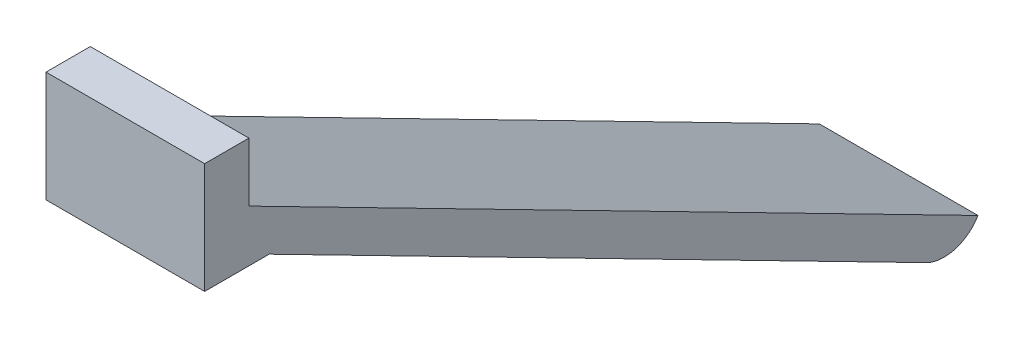
ISO-10303-21;
HEADER;
FILE_DESCRIPTION(('STEP AP214'),'2;1');
FILE_NAME('part.step','',(''),(''),'','','');
FILE_SCHEMA(('AUTOMOTIVE_DESIGN { 1 0 10303 214 1 1 1 1 }'));
ENDSEC;
DATA;
#1=APPLICATION_CONTEXT('core data for automotive mechanical design processes');
#2=APPLICATION_PROTOCOL_DEFINITION('international standard','automotive_design',2000,#1);
#3=PRODUCT_CONTEXT('',#1,'mechanical');
#4=PRODUCT('Part','Part','',(#3));
#5=PRODUCT_RELATED_PRODUCT_CATEGORY('part','',(#4));
#6=PRODUCT_DEFINITION_FORMATION('','',#4);
#7=PRODUCT_DEFINITION_CONTEXT('part definition',#1,'design');
#8=PRODUCT_DEFINITION('design','',#6,#7);
#9=PRODUCT_DEFINITION_SHAPE('','',#8);
#10=(LENGTH_UNIT() NAMED_UNIT(*) SI_UNIT(.MILLI.,.METRE.));
#11=(NAMED_UNIT(*) PLANE_ANGLE_UNIT() SI_UNIT($,.RADIAN.));
#12=(NAMED_UNIT(*) SI_UNIT($,.STERADIAN.) SOLID_ANGLE_UNIT());
#13=UNCERTAINTY_MEASURE_WITH_UNIT(LENGTH_MEASURE(1.E-05),#10,'distance_accuracy_value','');
#14=(GEOMETRIC_REPRESENTATION_CONTEXT(3) GLOBAL_UNCERTAINTY_ASSIGNED_CONTEXT((#13)) GLOBAL_UNIT_ASSIGNED_CONTEXT((#10,
#11,#12)) REPRESENTATION_CONTEXT('',''));
#15=CARTESIAN_POINT('',(0.,0.,0.));
#16=DIRECTION('',(0.,0.,1.));
#17=DIRECTION('',(1.,0.,0.));
#18=AXIS2_PLACEMENT_3D('',#15,#16,#17);
#19=CARTESIAN_POINT('',(4.3,-15.6626151043732,10.5969616533279));
#20=DIRECTION('',(-1.,0.,0.));
#21=DIRECTION('',(0.,0.,1.));
#22=AXIS2_PLACEMENT_3D('',#19,#20,#21);
#23=CYLINDRICAL_SURFACE('',#22,1.06981814994034);
#24=CARTESIAN_POINT('',(0.,-15.6626151043732,10.5969616533279));
#25=DIRECTION('',(1.,0.,0.));
#26=DIRECTION('',(0.,0.,-1.));
#27=AXIS2_PLACEMENT_3D('',#24,#25,#26);
#28=CIRCLE('',#27,1.06981814994034);
#29=CARTESIAN_POINT('',(0.,-16.2106458638047,9.67817268916985));
#30=VERTEX_POINT('',#29);
#31=CARTESIAN_POINT('',(0.,-16.6152107969963,11.0838623827767));
#32=VERTEX_POINT('',#31);
#33=EDGE_CURVE('E123',#30,#32,#28,.F.);
#34=ORIENTED_EDGE('',*,*,#33,.F.);
#35=DIRECTION('',(-1.,0.,0.));
#36=VECTOR('',#35,1.);
#37=CARTESIAN_POINT('',(4.3,-16.2106458638047,9.67817268916985));
#38=LINE('',#37,#36);
#39=CARTESIAN_POINT('',(4.3,-16.2106458638047,9.67817268916985));
#40=VERTEX_POINT('',#39);
#41=EDGE_CURVE('E11',#40,#30,#38,.T.);
#42=ORIENTED_EDGE('',*,*,#41,.F.);
#43=CARTESIAN_POINT('',(4.3,-15.6626151043732,10.5969616533279));
#44=DIRECTION('',(1.,0.,0.));
#45=DIRECTION('',(0.,0.,-1.));
#46=AXIS2_PLACEMENT_3D('',#43,#44,#45);
#47=CIRCLE('',#46,1.06981814994034);
#48=CARTESIAN_POINT('',(4.3,-16.6152107969963,11.0838623827767));
#49=VERTEX_POINT('',#48);
#50=EDGE_CURVE('E138',#40,#49,#47,.F.);
#51=ORIENTED_EDGE('',*,*,#50,.T.);
#52=DIRECTION('',(-1.,0.,0.));
#53=VECTOR('',#52,1.);
#54=CARTESIAN_POINT('',(4.3,-16.6152107969963,11.0838623827767));
#55=LINE('',#54,#53);
#56=EDGE_CURVE('E52',#49,#32,#55,.T.);
#57=ORIENTED_EDGE('',*,*,#56,.T.);
#58=EDGE_LOOP('',(#34,#42,#51,#57));
#59=FACE_BOUND('',#58,.T.);
#60=ADVANCED_FACE('F36',(#59),#23,.T.);
#61=CARTESIAN_POINT('',(4.3,-16.7749307187408,8.57417902123448));
#62=DIRECTION('',(0.,-0.890427679392244,0.455124760666944));
#63=DIRECTION('',(0.,-0.455124760666944,-0.890427679392244));
#64=AXIS2_PLACEMENT_3D('',#61,#62,#63);
#65=PLANE('',#64);
#66=DIRECTION('',(0.,0.455124760666944,0.890427679392244));
#67=VECTOR('',#66,1.);
#68=CARTESIAN_POINT('',(0.,-16.7749307187408,8.57417902123448));
#69=LINE('',#68,#67);
#70=CARTESIAN_POINT('',(0.,-6.10853796507725,29.4424159706215));
#71=VERTEX_POINT('',#70);
#72=EDGE_CURVE('E125',#30,#71,#69,.T.);
#73=ORIENTED_EDGE('',*,*,#72,.T.);
#74=DIRECTION('',(-1.,0.,0.));
#75=VECTOR('',#74,1.);
#76=CARTESIAN_POINT('',(4.3,-6.10853796507725,29.4424159706215));
#77=LINE('',#76,#75);
#78=CARTESIAN_POINT('',(4.3,-6.10853796507725,29.4424159706215));
#79=VERTEX_POINT('',#78);
#80=EDGE_CURVE('E44',#79,#71,#77,.T.);
#81=ORIENTED_EDGE('',*,*,#80,.F.);
#82=DIRECTION('',(0.,0.455124760666944,0.890427679392244));
#83=VECTOR('',#82,1.);
#84=CARTESIAN_POINT('',(4.3,-16.7749307187408,8.57417902123448));
#85=LINE('',#84,#83);
#86=EDGE_CURVE('E159',#40,#79,#85,.T.);
#87=ORIENTED_EDGE('',*,*,#86,.F.);
#88=ORIENTED_EDGE('',*,*,#41,.T.);
#89=EDGE_LOOP('',(#73,#81,#87,#88));
#90=FACE_BOUND('',#89,.T.);
#91=ADVANCED_FACE('F174',(#90),#65,.F.);
#92=CARTESIAN_POINT('',(4.3,0.,29.4424159706215));
#93=DIRECTION('',(0.,0.,1.));
#94=DIRECTION('',(1.,0.,0.));
#95=AXIS2_PLACEMENT_3D('',#92,#93,#94);
#96=PLANE('',#95);
#97=DIRECTION('',(0.,1.,0.));
#98=VECTOR('',#97,1.);
#99=CARTESIAN_POINT('',(0.,0.,29.4424159706215));
#100=LINE('',#99,#98);
#101=CARTESIAN_POINT('',(0.,-4.51271558365736,29.4424159706215));
#102=VERTEX_POINT('',#101);
#103=EDGE_CURVE('E127',#71,#102,#100,.T.);
#104=ORIENTED_EDGE('',*,*,#103,.T.);
#105=DIRECTION('',(-1.,0.,0.));
#106=VECTOR('',#105,1.);
#107=CARTESIAN_POINT('',(4.3,-4.51271558365736,29.4424159706215));
#108=LINE('',#107,#106);
#109=CARTESIAN_POINT('',(4.3,-4.51271558365736,29.4424159706215));
#110=VERTEX_POINT('',#109);
#111=EDGE_CURVE('E142',#110,#102,#108,.T.);
#112=ORIENTED_EDGE('',*,*,#111,.F.);
#113=DIRECTION('',(0.,1.,0.));
#114=VECTOR('',#113,1.);
#115=CARTESIAN_POINT('',(4.3,0.,29.4424159706215));
#116=LINE('',#115,#114);
#117=EDGE_CURVE('E151',#79,#110,#116,.T.);
#118=ORIENTED_EDGE('',*,*,#117,.F.);
#119=ORIENTED_EDGE('',*,*,#80,.T.);
#120=EDGE_LOOP('',(#104,#112,#118,#119));
#121=FACE_BOUND('',#120,.T.);
#122=ADVANCED_FACE('F149',(#121),#96,.F.);
#123=CARTESIAN_POINT('',(4.3,-4.51271558365736,0.));
#124=DIRECTION('',(0.,-1.,0.));
#125=DIRECTION('',(0.,0.,-1.));
#126=AXIS2_PLACEMENT_3D('',#123,#124,#125);
#127=PLANE('',#126);
#128=DIRECTION('',(0.,0.,1.));
#129=VECTOR('',#128,1.);
#130=CARTESIAN_POINT('',(0.,-4.51271558365736,0.));
#131=LINE('',#130,#129);
#132=CARTESIAN_POINT('',(0.,-4.51271558365736,30.6424159706215));
#133=VERTEX_POINT('',#132);
#134=EDGE_CURVE('E129',#102,#133,#131,.T.);
#135=ORIENTED_EDGE('',*,*,#134,.T.);
#136=DIRECTION('',(-1.,0.,0.));
#137=VECTOR('',#136,1.);
#138=CARTESIAN_POINT('',(4.3,-4.51271558365736,30.6424159706215));
#139=LINE('',#138,#137);
#140=CARTESIAN_POINT('',(4.3,-4.51271558365736,30.6424159706215));
#141=VERTEX_POINT('',#140);
#142=EDGE_CURVE('E105',#141,#133,#139,.T.);
#143=ORIENTED_EDGE('',*,*,#142,.F.);
#144=DIRECTION('',(0.,0.,1.));
#145=VECTOR('',#144,1.);
#146=CARTESIAN_POINT('',(4.3,-4.51271558365736,0.));
#147=LINE('',#146,#145);
#148=EDGE_CURVE('E114',#110,#141,#147,.T.);
#149=ORIENTED_EDGE('',*,*,#148,.F.);
#150=ORIENTED_EDGE('',*,*,#111,.T.);
#151=EDGE_LOOP('',(#135,#143,#149,#150));
#152=FACE_BOUND('',#151,.T.);
#153=ADVANCED_FACE('F158',(#152),#127,.F.);
#154=CARTESIAN_POINT('',(4.3,0.,30.6424159706215));
#155=DIRECTION('',(0.,0.,1.));
#156=DIRECTION('',(1.,0.,0.));
#157=AXIS2_PLACEMENT_3D('',#154,#155,#156);
#158=PLANE('',#157);
#159=DIRECTION('',(0.,1.,0.));
#160=VECTOR('',#159,1.);
#161=CARTESIAN_POINT('',(0.,0.,30.6424159706215));
#162=LINE('',#161,#160);
#163=CARTESIAN_POINT('',(0.,-7.51271558365736,30.6424159706215));
#164=VERTEX_POINT('',#163);
#165=EDGE_CURVE('E101',#164,#133,#162,.T.);
#166=ORIENTED_EDGE('',*,*,#165,.F.);
#167=DIRECTION('',(-1.,0.,0.));
#168=VECTOR('',#167,1.);
#169=CARTESIAN_POINT('',(4.3,-7.51271558365736,30.6424159706215));
#170=LINE('',#169,#168);
#171=CARTESIAN_POINT('',(4.3,-7.51271558365736,30.6424159706215));
#172=VERTEX_POINT('',#171);
#173=EDGE_CURVE('E96',#172,#164,#170,.T.);
#174=ORIENTED_EDGE('',*,*,#173,.F.);
#175=DIRECTION('',(0.,1.,0.));
#176=VECTOR('',#175,1.);
#177=CARTESIAN_POINT('',(4.3,0.,30.6424159706215));
#178=LINE('',#177,#176);
#179=EDGE_CURVE('E99',#172,#141,#178,.T.);
#180=ORIENTED_EDGE('',*,*,#179,.T.);
#181=ORIENTED_EDGE('',*,*,#142,.T.);
#182=EDGE_LOOP('',(#166,#174,#180,#181));
#183=FACE_BOUND('',#182,.T.);
#184=ADVANCED_FACE('F98',(#183),#158,.T.);
#185=CARTESIAN_POINT('',(4.3,-7.51271558365736,0.));
#186=DIRECTION('',(0.,-1.,0.));
#187=DIRECTION('',(0.,0.,-1.));
#188=AXIS2_PLACEMENT_3D('',#185,#186,#187);
#189=PLANE('',#188);
#190=DIRECTION('',(0.,0.,1.));
#191=VECTOR('',#190,1.);
#192=CARTESIAN_POINT('',(0.,-7.51271558365736,0.));
#193=LINE('',#192,#191);
#194=CARTESIAN_POINT('',(0.,-7.51271558365736,28.8924159706215));
#195=VERTEX_POINT('',#194);
#196=EDGE_CURVE('E133',#195,#164,#193,.T.);
#197=ORIENTED_EDGE('',*,*,#196,.F.);
#198=DIRECTION('',(-1.,0.,0.));
#199=VECTOR('',#198,1.);
#200=CARTESIAN_POINT('',(4.3,-7.51271558365736,28.8924159706215));
#201=LINE('',#200,#199);
#202=CARTESIAN_POINT('',(4.3,-7.51271558365736,28.8924159706215));
#203=VERTEX_POINT('',#202);
#204=EDGE_CURVE('E74',#203,#195,#201,.T.);
#205=ORIENTED_EDGE('',*,*,#204,.F.);
#206=DIRECTION('',(0.,0.,1.));
#207=VECTOR('',#206,1.);
#208=CARTESIAN_POINT('',(4.3,-7.51271558365736,0.));
#209=LINE('',#208,#207);
#210=EDGE_CURVE('E112',#203,#172,#209,.T.);
#211=ORIENTED_EDGE('',*,*,#210,.T.);
#212=ORIENTED_EDGE('',*,*,#173,.T.);
#213=EDGE_LOOP('',(#197,#205,#211,#212));
#214=FACE_BOUND('',#213,.T.);
#215=ADVANCED_FACE('F117',(#214),#189,.T.);
#216=CARTESIAN_POINT('',(4.3,-17.665358398133,9.02930378190142));
#217=DIRECTION('',(0.,-0.890427679392244,0.455124760666944));
#218=DIRECTION('',(0.,-0.455124760666944,-0.890427679392244));
#219=AXIS2_PLACEMENT_3D('',#216,#217,#218);
#220=PLANE('',#219);
#221=DIRECTION('',(0.,0.455124760666944,0.890427679392244));
#222=VECTOR('',#221,1.);
#223=CARTESIAN_POINT('',(0.,-17.665358398133,9.02930378190142));
#224=LINE('',#223,#222);
#225=EDGE_CURVE('E135',#32,#195,#224,.T.);
#226=ORIENTED_EDGE('',*,*,#225,.F.);
#227=ORIENTED_EDGE('',*,*,#56,.F.);
#228=DIRECTION('',(0.,0.455124760666944,0.890427679392244));
#229=VECTOR('',#228,1.);
#230=CARTESIAN_POINT('',(4.3,-17.665358398133,9.02930378190142));
#231=LINE('',#230,#229);
#232=EDGE_CURVE('E118',#49,#203,#231,.T.);
#233=ORIENTED_EDGE('',*,*,#232,.T.);
#234=ORIENTED_EDGE('',*,*,#204,.T.);
#235=EDGE_LOOP('',(#226,#227,#233,#234));
#236=FACE_BOUND('',#235,.T.);
#237=ADVANCED_FACE('F163',(#236),#220,.T.);
#238=CARTESIAN_POINT('',(4.3,0.,0.));
#239=DIRECTION('',(1.,0.,0.));
#240=DIRECTION('',(0.,0.,-1.));
#241=AXIS2_PLACEMENT_3D('',#238,#239,#240);
#242=PLANE('',#241);
#243=ORIENTED_EDGE('',*,*,#50,.F.);
#244=ORIENTED_EDGE('',*,*,#86,.T.);
#245=ORIENTED_EDGE('',*,*,#117,.T.);
#246=ORIENTED_EDGE('',*,*,#148,.T.);
#247=ORIENTED_EDGE('',*,*,#179,.F.);
#248=ORIENTED_EDGE('',*,*,#210,.F.);
#249=ORIENTED_EDGE('',*,*,#232,.F.);
#250=EDGE_LOOP('',(#243,#244,#245,#246,#247,#248,#249));
#251=FACE_BOUND('',#250,.T.);
#252=ADVANCED_FACE('F110',(#251),#242,.T.);
#253=CARTESIAN_POINT('',(0.,0.,0.));
#254=DIRECTION('',(1.,0.,0.));
#255=DIRECTION('',(0.,0.,-1.));
#256=AXIS2_PLACEMENT_3D('',#253,#254,#255);
#257=PLANE('',#256);
#258=ORIENTED_EDGE('',*,*,#33,.T.);
#259=ORIENTED_EDGE('',*,*,#225,.T.);
#260=ORIENTED_EDGE('',*,*,#196,.T.);
#261=ORIENTED_EDGE('',*,*,#165,.T.);
#262=ORIENTED_EDGE('',*,*,#134,.F.);
#263=ORIENTED_EDGE('',*,*,#103,.F.);
#264=ORIENTED_EDGE('',*,*,#72,.F.);
#265=EDGE_LOOP('',(#258,#259,#260,#261,#262,#263,#264));
#266=FACE_BOUND('',#265,.T.);
#267=ADVANCED_FACE('F156',(#266),#257,.F.);
#268=CLOSED_SHELL('',(#60,#91,#122,#153,#184,#215,#237,#252,#267));
#269=MANIFOLD_SOLID_BREP('B2',#268);
#270=ADVANCED_BREP_SHAPE_REPRESENTATION('',(#18,#269),#14);
#271=SHAPE_DEFINITION_REPRESENTATION(#9,#270);
ENDSEC;
END-ISO-10303-21;
